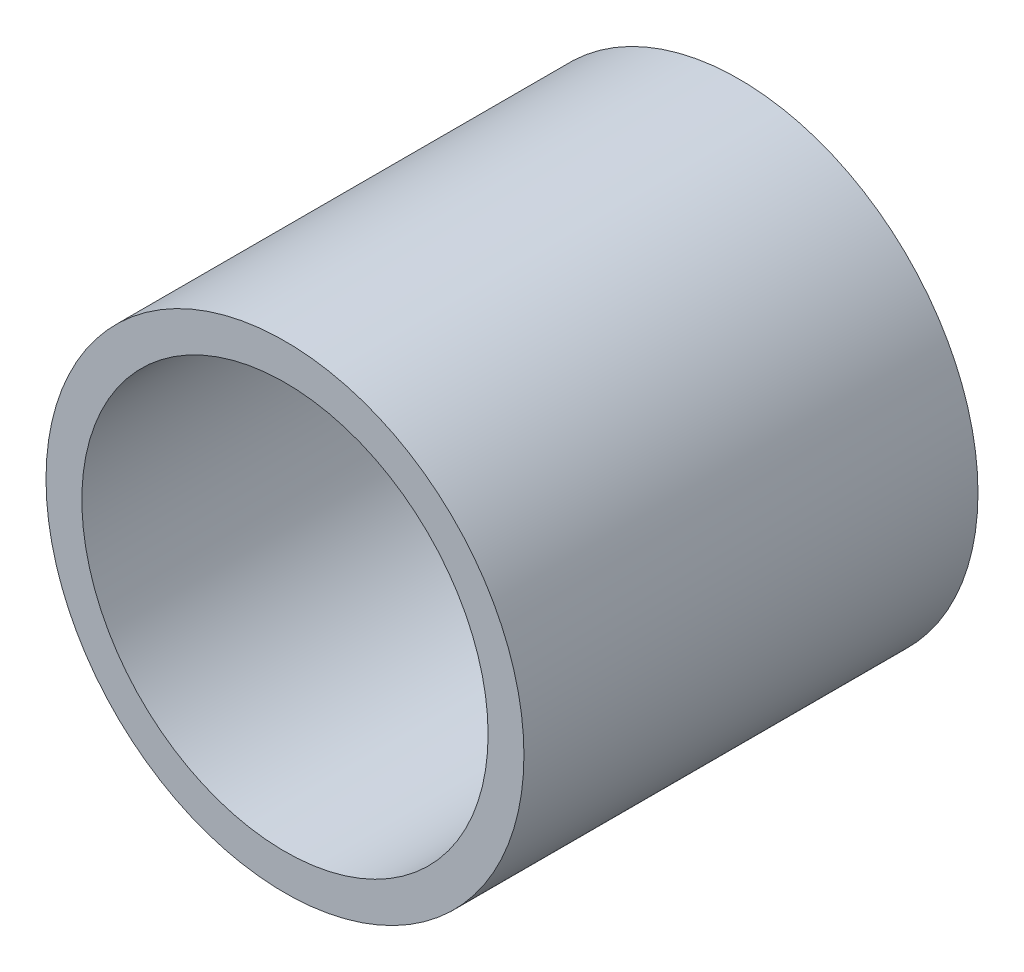
ISO-10303-21;
HEADER;
FILE_DESCRIPTION(('STEP AP214'),'2;1');
FILE_NAME('part.step','',(''),(''),'','','');
FILE_SCHEMA(('AUTOMOTIVE_DESIGN { 1 0 10303 214 1 1 1 1 }'));
ENDSEC;
DATA;
#1=APPLICATION_CONTEXT('core data for automotive mechanical design processes');
#2=APPLICATION_PROTOCOL_DEFINITION('international standard','automotive_design',2000,#1);
#3=PRODUCT_CONTEXT('',#1,'mechanical');
#4=PRODUCT('Part','Part','',(#3));
#5=PRODUCT_RELATED_PRODUCT_CATEGORY('part','',(#4));
#6=PRODUCT_DEFINITION_FORMATION('','',#4);
#7=PRODUCT_DEFINITION_CONTEXT('part definition',#1,'design');
#8=PRODUCT_DEFINITION('design','',#6,#7);
#9=PRODUCT_DEFINITION_SHAPE('','',#8);
#10=(LENGTH_UNIT() NAMED_UNIT(*) SI_UNIT(.MILLI.,.METRE.));
#11=(NAMED_UNIT(*) PLANE_ANGLE_UNIT() SI_UNIT($,.RADIAN.));
#12=(NAMED_UNIT(*) SI_UNIT($,.STERADIAN.) SOLID_ANGLE_UNIT());
#13=UNCERTAINTY_MEASURE_WITH_UNIT(LENGTH_MEASURE(1.E-05),#10,'distance_accuracy_value','');
#14=(GEOMETRIC_REPRESENTATION_CONTEXT(3) GLOBAL_UNCERTAINTY_ASSIGNED_CONTEXT((#13)) GLOBAL_UNIT_ASSIGNED_CONTEXT((#10,
#11,#12)) REPRESENTATION_CONTEXT('',''));
#15=CARTESIAN_POINT('',(0.,0.,0.));
#16=DIRECTION('',(0.,0.,1.));
#17=DIRECTION('',(1.,0.,0.));
#18=AXIS2_PLACEMENT_3D('',#15,#16,#17);
#19=CARTESIAN_POINT('',(0.,0.,38.));
#20=DIRECTION('',(0.,0.,1.));
#21=DIRECTION('',(1.,0.,0.));
#22=AXIS2_PLACEMENT_3D('',#19,#20,#21);
#23=PLANE('',#22);
#24=CARTESIAN_POINT('',(0.,0.,38.));
#25=DIRECTION('',(0.,0.,1.));
#26=DIRECTION('',(1.,0.,0.));
#27=AXIS2_PLACEMENT_3D('',#24,#25,#26);
#28=CIRCLE('',#27,20.);
#29=CARTESIAN_POINT('',(20.,0.,38.));
#30=VERTEX_POINT('',#29);
#31=EDGE_CURVE('E10',#30,#30,#28,.T.);
#32=ORIENTED_EDGE('',*,*,#31,.T.);
#33=EDGE_LOOP('',(#32));
#34=FACE_BOUND('',#33,.T.);
#35=CARTESIAN_POINT('',(0.,0.,38.));
#36=DIRECTION('',(0.,0.,1.));
#37=DIRECTION('',(1.,0.,0.));
#38=AXIS2_PLACEMENT_3D('',#35,#36,#37);
#39=CIRCLE('',#38,17.);
#40=CARTESIAN_POINT('',(17.,0.,38.));
#41=VERTEX_POINT('',#40);
#42=EDGE_CURVE('E39',#41,#41,#39,.T.);
#43=ORIENTED_EDGE('',*,*,#42,.F.);
#44=EDGE_LOOP('',(#43));
#45=FACE_BOUND('',#44,.T.);
#46=ADVANCED_FACE('F28',(#34,#45),#23,.T.);
#47=CARTESIAN_POINT('',(0.,0.,0.));
#48=DIRECTION('',(0.,0.,1.));
#49=DIRECTION('',(1.,0.,0.));
#50=AXIS2_PLACEMENT_3D('',#47,#48,#49);
#51=PLANE('',#50);
#52=CARTESIAN_POINT('',(0.,0.,0.));
#53=DIRECTION('',(0.,0.,1.));
#54=DIRECTION('',(1.,0.,0.));
#55=AXIS2_PLACEMENT_3D('',#52,#53,#54);
#56=CIRCLE('',#55,20.);
#57=CARTESIAN_POINT('',(20.,0.,0.));
#58=VERTEX_POINT('',#57);
#59=EDGE_CURVE('E32',#58,#58,#56,.T.);
#60=ORIENTED_EDGE('',*,*,#59,.F.);
#61=EDGE_LOOP('',(#60));
#62=FACE_BOUND('',#61,.T.);
#63=CARTESIAN_POINT('',(0.,0.,0.));
#64=DIRECTION('',(0.,0.,1.));
#65=DIRECTION('',(1.,0.,0.));
#66=AXIS2_PLACEMENT_3D('',#63,#64,#65);
#67=CIRCLE('',#66,17.);
#68=CARTESIAN_POINT('',(17.,0.,0.));
#69=VERTEX_POINT('',#68);
#70=EDGE_CURVE('E41',#69,#69,#67,.T.);
#71=ORIENTED_EDGE('',*,*,#70,.T.);
#72=EDGE_LOOP('',(#71));
#73=FACE_BOUND('',#72,.T.);
#74=ADVANCED_FACE('F51',(#62,#73),#51,.F.);
#75=CARTESIAN_POINT('',(0.,0.,38.));
#76=DIRECTION('',(0.,0.,-1.));
#77=DIRECTION('',(-1.,0.,0.));
#78=AXIS2_PLACEMENT_3D('',#75,#76,#77);
#79=CYLINDRICAL_SURFACE('',#78,20.);
#80=ORIENTED_EDGE('',*,*,#31,.F.);
#81=EDGE_LOOP('',(#80));
#82=FACE_BOUND('',#81,.T.);
#83=ORIENTED_EDGE('',*,*,#59,.T.);
#84=EDGE_LOOP('',(#83));
#85=FACE_BOUND('',#84,.T.);
#86=ADVANCED_FACE('F30',(#82,#85),#79,.T.);
#87=CARTESIAN_POINT('',(0.,0.,38.));
#88=DIRECTION('',(0.,0.,-1.));
#89=DIRECTION('',(-1.,0.,0.));
#90=AXIS2_PLACEMENT_3D('',#87,#88,#89);
#91=CYLINDRICAL_SURFACE('',#90,17.);
#92=ORIENTED_EDGE('',*,*,#42,.T.);
#93=EDGE_LOOP('',(#92));
#94=FACE_BOUND('',#93,.T.);
#95=ORIENTED_EDGE('',*,*,#70,.F.);
#96=EDGE_LOOP('',(#95));
#97=FACE_BOUND('',#96,.T.);
#98=ADVANCED_FACE('F47',(#94,#97),#91,.F.);
#99=CLOSED_SHELL('',(#46,#74,#86,#98));
#100=MANIFOLD_SOLID_BREP('B2',#99);
#101=ADVANCED_BREP_SHAPE_REPRESENTATION('',(#18,#100),#14);
#102=SHAPE_DEFINITION_REPRESENTATION(#9,#101);
ENDSEC;
END-ISO-10303-21;
